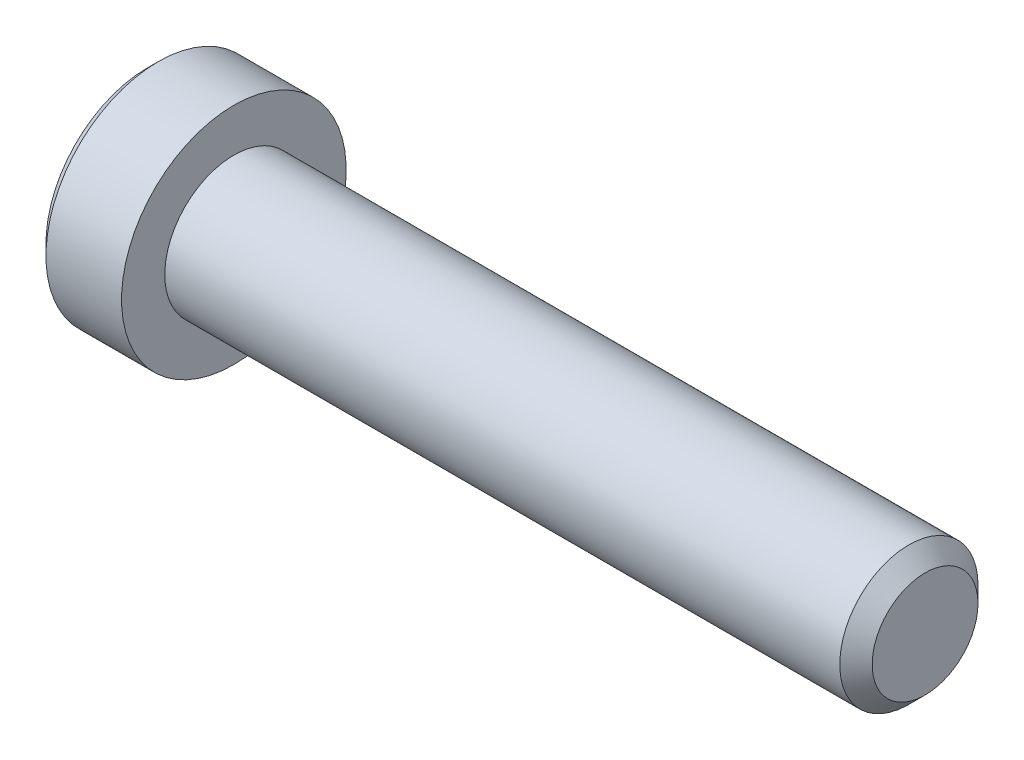
ISO-10303-21;
HEADER;
FILE_DESCRIPTION(('STEP AP214'),'2;1');
FILE_NAME('part.step','',(''),(''),'','','');
FILE_SCHEMA(('AUTOMOTIVE_DESIGN { 1 0 10303 214 1 1 1 1 }'));
ENDSEC;
DATA;
#1=APPLICATION_CONTEXT('core data for automotive mechanical design processes');
#2=APPLICATION_PROTOCOL_DEFINITION('international standard','automotive_design',2000,#1);
#3=PRODUCT_CONTEXT('',#1,'mechanical');
#4=PRODUCT('Part','Part','',(#3));
#5=PRODUCT_RELATED_PRODUCT_CATEGORY('part','',(#4));
#6=PRODUCT_DEFINITION_FORMATION('','',#4);
#7=PRODUCT_DEFINITION_CONTEXT('part definition',#1,'design');
#8=PRODUCT_DEFINITION('design','',#6,#7);
#9=PRODUCT_DEFINITION_SHAPE('','',#8);
#10=(LENGTH_UNIT() NAMED_UNIT(*) SI_UNIT(.MILLI.,.METRE.));
#11=(NAMED_UNIT(*) PLANE_ANGLE_UNIT() SI_UNIT($,.RADIAN.));
#12=(NAMED_UNIT(*) SI_UNIT($,.STERADIAN.) SOLID_ANGLE_UNIT());
#13=UNCERTAINTY_MEASURE_WITH_UNIT(LENGTH_MEASURE(1.E-05),#10,'distance_accuracy_value','');
#14=(GEOMETRIC_REPRESENTATION_CONTEXT(3) GLOBAL_UNCERTAINTY_ASSIGNED_CONTEXT((#13)) GLOBAL_UNIT_ASSIGNED_CONTEXT((#10,
#11,#12)) REPRESENTATION_CONTEXT('',''));
#15=CARTESIAN_POINT('',(0.,0.,0.));
#16=DIRECTION('',(0.,0.,1.));
#17=DIRECTION('',(1.,0.,0.));
#18=AXIS2_PLACEMENT_3D('',#15,#16,#17);
#19=CARTESIAN_POINT('',(-25.,5.87499999999999,0.));
#20=DIRECTION('',(-1.,0.,0.));
#21=DIRECTION('',(0.,-1.,0.));
#22=AXIS2_PLACEMENT_3D('',#19,#20,#21);
#23=PLANE('',#22);
#24=CARTESIAN_POINT('',(-25.,0.,0.));
#25=DIRECTION('',(-1.,0.,0.));
#26=DIRECTION('',(0.,-1.,0.));
#27=AXIS2_PLACEMENT_3D('',#24,#25,#26);
#28=CIRCLE('',#27,2.88675134594805);
#29=CARTESIAN_POINT('',(-25.,-2.886751345948,-2.21827764490534E-13));
#30=VERTEX_POINT('',#29);
#31=CARTESIAN_POINT('',(-25.,-1.44337567297417,2.49999999999982));
#32=VERTEX_POINT('',#31);
#33=EDGE_CURVE('E132',#30,#32,#28,.T.);
#34=ORIENTED_EDGE('',*,*,#33,.F.);
#35=CARTESIAN_POINT('',(-25.,-1.44337567297406,-2.5));
#36=VERTEX_POINT('',#35);
#37=EDGE_CURVE('E131',#36,#30,#28,.T.);
#38=ORIENTED_EDGE('',*,*,#37,.F.);
#39=CARTESIAN_POINT('',(-25.,1.44337567297395,-2.5));
#40=VERTEX_POINT('',#39);
#41=EDGE_CURVE('E101',#40,#36,#28,.T.);
#42=ORIENTED_EDGE('',*,*,#41,.F.);
#43=CARTESIAN_POINT('',(-25.,2.88675134594809,0.));
#44=VERTEX_POINT('',#43);
#45=EDGE_CURVE('E94',#44,#40,#28,.T.);
#46=ORIENTED_EDGE('',*,*,#45,.F.);
#47=CARTESIAN_POINT('',(-25.,1.44337567297395,2.5));
#48=VERTEX_POINT('',#47);
#49=EDGE_CURVE('E55',#48,#44,#28,.T.);
#50=ORIENTED_EDGE('',*,*,#49,.F.);
#51=EDGE_CURVE('E62',#32,#48,#28,.T.);
#52=ORIENTED_EDGE('',*,*,#51,.F.);
#53=EDGE_LOOP('',(#34,#38,#42,#46,#50,#52));
#54=FACE_BOUND('',#53,.T.);
#55=CARTESIAN_POINT('',(-25.,0.,0.));
#56=DIRECTION('',(1.,0.,0.));
#57=DIRECTION('',(0.,1.,0.));
#58=AXIS2_PLACEMENT_3D('',#55,#56,#57);
#59=CIRCLE('',#58,5.87499999999999);
#60=CARTESIAN_POINT('',(-25.,5.87499999999999,0.));
#61=VERTEX_POINT('',#60);
#62=EDGE_CURVE('E221',#61,#61,#59,.T.);
#63=ORIENTED_EDGE('',*,*,#62,.F.);
#64=EDGE_LOOP('',(#63));
#65=FACE_BOUND('',#64,.T.);
#66=ADVANCED_FACE('F35',(#54,#65),#23,.T.);
#67=CARTESIAN_POINT('',(-2.,0.,0.));
#68=DIRECTION('',(1.,0.,0.));
#69=DIRECTION('',(0.,0.,-1.));
#70=AXIS2_PLACEMENT_3D('',#67,#68,#69);
#71=CYLINDRICAL_SURFACE('',#70,4.);
#72=CARTESIAN_POINT('',(19.0625,0.,0.));
#73=DIRECTION('',(1.,0.,0.));
#74=DIRECTION('',(0.,0.,-1.));
#75=AXIS2_PLACEMENT_3D('',#72,#73,#74);
#76=CIRCLE('',#75,4.);
#77=CARTESIAN_POINT('',(19.0625,0.,-4.));
#78=VERTEX_POINT('',#77);
#79=EDGE_CURVE('E49',#78,#78,#76,.F.);
#80=ORIENTED_EDGE('',*,*,#79,.T.);
#81=EDGE_LOOP('',(#80));
#82=FACE_BOUND('',#81,.T.);
#83=CARTESIAN_POINT('',(-20.,0.,0.));
#84=DIRECTION('',(-1.,0.,0.));
#85=DIRECTION('',(0.,-1.,0.));
#86=AXIS2_PLACEMENT_3D('',#83,#84,#85);
#87=CIRCLE('',#86,4.);
#88=CARTESIAN_POINT('',(-20.,-4.00000000000001,0.));
#89=VERTEX_POINT('',#88);
#90=EDGE_CURVE('E214',#89,#89,#87,.T.);
#91=ORIENTED_EDGE('',*,*,#90,.F.);
#92=EDGE_LOOP('',(#91));
#93=FACE_BOUND('',#92,.T.);
#94=ADVANCED_FACE('F194',(#82,#93),#71,.T.);
#95=CARTESIAN_POINT('',(20.,0.,0.));
#96=DIRECTION('',(1.,0.,0.));
#97=DIRECTION('',(0.,0.,-1.));
#98=AXIS2_PLACEMENT_3D('',#95,#96,#97);
#99=PLANE('',#98);
#100=CARTESIAN_POINT('',(20.,0.,0.));
#101=DIRECTION('',(1.,0.,0.));
#102=DIRECTION('',(0.,0.,-1.));
#103=AXIS2_PLACEMENT_3D('',#100,#101,#102);
#104=CIRCLE('',#103,3.0625);
#105=CARTESIAN_POINT('',(20.,0.,-3.0625));
#106=VERTEX_POINT('',#105);
#107=EDGE_CURVE('E215',#106,#106,#104,.T.);
#108=ORIENTED_EDGE('',*,*,#107,.T.);
#109=EDGE_LOOP('',(#108));
#110=FACE_BOUND('',#109,.T.);
#111=ADVANCED_FACE('F202',(#110),#99,.T.);
#112=CARTESIAN_POINT('',(20.,0.,0.));
#113=DIRECTION('',(-1.,0.,0.));
#114=DIRECTION('',(0.,0.,1.));
#115=AXIS2_PLACEMENT_3D('',#112,#113,#114);
#116=CONICAL_SURFACE('',#115,3.0625,0.785398163397447);
#117=ORIENTED_EDGE('',*,*,#79,.F.);
#118=EDGE_LOOP('',(#117));
#119=FACE_BOUND('',#118,.T.);
#120=ORIENTED_EDGE('',*,*,#107,.F.);
#121=EDGE_LOOP('',(#120));
#122=FACE_BOUND('',#121,.T.);
#123=ADVANCED_FACE('F37',(#119,#122),#116,.T.);
#124=CARTESIAN_POINT('',(-20.,0.,0.));
#125=DIRECTION('',(1.,0.,0.));
#126=DIRECTION('',(0.,1.,0.));
#127=AXIS2_PLACEMENT_3D('',#124,#125,#126);
#128=CYLINDRICAL_SURFACE('',#127,6.5);
#129=CARTESIAN_POINT('',(-24.375,0.,0.));
#130=DIRECTION('',(1.,0.,0.));
#131=DIRECTION('',(0.,1.,0.));
#132=AXIS2_PLACEMENT_3D('',#129,#130,#131);
#133=CIRCLE('',#132,6.49999999999999);
#134=CARTESIAN_POINT('',(-24.375,6.49999999999999,0.));
#135=VERTEX_POINT('',#134);
#136=EDGE_CURVE('E216',#135,#135,#133,.T.);
#137=ORIENTED_EDGE('',*,*,#136,.T.);
#138=EDGE_LOOP('',(#137));
#139=FACE_BOUND('',#138,.T.);
#140=CARTESIAN_POINT('',(-20.,0.,0.));
#141=DIRECTION('',(1.,0.,0.));
#142=DIRECTION('',(0.,1.,0.));
#143=AXIS2_PLACEMENT_3D('',#140,#141,#142);
#144=CIRCLE('',#143,6.5);
#145=CARTESIAN_POINT('',(-20.,6.49999999999999,0.));
#146=VERTEX_POINT('',#145);
#147=EDGE_CURVE('E226',#146,#146,#144,.T.);
#148=ORIENTED_EDGE('',*,*,#147,.F.);
#149=EDGE_LOOP('',(#148));
#150=FACE_BOUND('',#149,.T.);
#151=ADVANCED_FACE('F197',(#139,#150),#128,.T.);
#152=CARTESIAN_POINT('',(-24.375,0.,0.));
#153=DIRECTION('',(1.,0.,0.));
#154=DIRECTION('',(0.,1.,0.));
#155=AXIS2_PLACEMENT_3D('',#152,#153,#154);
#156=CONICAL_SURFACE('',#155,6.49999999999999,0.785398163397448);
#157=ORIENTED_EDGE('',*,*,#62,.T.);
#158=EDGE_LOOP('',(#157));
#159=FACE_BOUND('',#158,.T.);
#160=ORIENTED_EDGE('',*,*,#136,.F.);
#161=EDGE_LOOP('',(#160));
#162=FACE_BOUND('',#161,.T.);
#163=ADVANCED_FACE('F190',(#159,#162),#156,.T.);
#164=CARTESIAN_POINT('',(-20.,6.49999999999999,0.));
#165=DIRECTION('',(1.,0.,0.));
#166=DIRECTION('',(0.,1.,0.));
#167=AXIS2_PLACEMENT_3D('',#164,#165,#166);
#168=PLANE('',#167);
#169=ORIENTED_EDGE('',*,*,#90,.T.);
#170=EDGE_LOOP('',(#169));
#171=FACE_BOUND('',#170,.T.);
#172=ORIENTED_EDGE('',*,*,#147,.T.);
#173=EDGE_LOOP('',(#172));
#174=FACE_BOUND('',#173,.T.);
#175=ADVANCED_FACE('F154',(#171,#174),#168,.T.);
#176=CARTESIAN_POINT('',(-25.,0.,0.));
#177=DIRECTION('',(-1.,0.,0.));
#178=DIRECTION('',(0.,-1.,0.));
#179=AXIS2_PLACEMENT_3D('',#176,#177,#178);
#180=CONICAL_SURFACE('',#179,2.88675134594805,0.78539816339745);
#181=CARTESIAN_POINT('',(-25.9259641937848,-2.87868021616152,-2.5));
#182=CARTESIAN_POINT('',(-25.8730547693996,-2.80858751756352,-2.5));
#183=CARTESIAN_POINT('',(-25.8206567848066,-2.73810237384455,-2.5));
#184=CARTESIAN_POINT('',(-25.7171126835153,-2.59619238907467,-2.5));
#185=CARTESIAN_POINT('',(-25.665966884378,-2.5247673165714,-2.5));
#186=CARTESIAN_POINT('',(-25.5647924979815,-2.38030019419695,-2.5));
#187=CARTESIAN_POINT('',(-25.5147756377846,-2.30724990359397,-2.5));
#188=CARTESIAN_POINT('',(-25.4166088439156,-2.15990937397291,-2.5));
#189=CARTESIAN_POINT('',(-25.3684587783456,-2.0856192230894,-2.5));
#190=CARTESIAN_POINT('',(-25.2717465594521,-1.93130274871405,-2.5));
#191=CARTESIAN_POINT('',(-25.2233189325374,-1.85119168497847,-2.5));
#192=CARTESIAN_POINT('',(-25.1296640597042,-1.68912282627165,-2.5));
#193=CARTESIAN_POINT('',(-25.0844363916949,-1.60716527674861,-2.5));
#194=CARTESIAN_POINT('',(-24.9981353746694,-1.44137668632316,-2.5));
#195=CARTESIAN_POINT('',(-24.9570503726637,-1.35755175925793,-2.5));
#196=CARTESIAN_POINT('',(-24.8799618661067,-1.18761577759417,-2.5));
#197=CARTESIAN_POINT('',(-24.8439560607347,-1.10150577924726,-2.5));
#198=CARTESIAN_POINT('',(-24.7809497442852,-0.933895283730339,-2.5));
#199=CARTESIAN_POINT('',(-24.7534577201432,-0.852581486652376,-2.5));
#200=CARTESIAN_POINT('',(-24.7049971144175,-0.687996185051388,-2.5));
#201=CARTESIAN_POINT('',(-24.6840289822391,-0.604724546085125,-2.5));
#202=CARTESIAN_POINT('',(-24.6500599950131,-0.438105786501611,-2.5));
#203=CARTESIAN_POINT('',(-24.6369226334437,-0.354786957377843,-2.5));
#204=CARTESIAN_POINT('',(-24.6188701943997,-0.187258638268732,-2.5));
#205=CARTESIAN_POINT('',(-24.6139537035303,-0.103049303891692,-2.5));
#206=CARTESIAN_POINT('',(-24.612708074372,0.0623819458555907,-2.5));
#207=CARTESIAN_POINT('',(-24.616074551711,0.143601667742536,-2.5));
#208=CARTESIAN_POINT('',(-24.630537592381,0.305344840534007,-2.5));
#209=CARTESIAN_POINT('',(-24.6416349066532,0.3858682230297,-2.5));
#210=CARTESIAN_POINT('',(-24.6711420785854,0.546999992477774,-2.5));
#211=CARTESIAN_POINT('',(-24.689676376831,0.627585258156424,-2.5));
#212=CARTESIAN_POINT('',(-24.7330723320141,0.786991930978632,-2.5));
#213=CARTESIAN_POINT('',(-24.7579334595175,0.865813485110869,-2.5));
#214=CARTESIAN_POINT('',(-24.8455589112399,1.11399280220495,-2.5));
#215=CARTESIAN_POINT('',(-24.9183033354747,1.27984027529461,-2.5));
#216=CARTESIAN_POINT('',(-25.0395423452679,1.52253018655043,-2.5));
#217=CARTESIAN_POINT('',(-25.0820714512073,1.60256472908883,-2.5));
#218=CARTESIAN_POINT('',(-25.1703965241523,1.76081489282129,-2.5));
#219=CARTESIAN_POINT('',(-25.2161919024768,1.83903083842891,-2.5));
#220=CARTESIAN_POINT('',(-25.3080446787287,1.99000684607172,-2.5));
#221=CARTESIAN_POINT('',(-25.3539756354245,2.06284472030449,-2.5));
#222=CARTESIAN_POINT('',(-25.4477702453866,2.20727164736139,-2.5));
#223=CARTESIAN_POINT('',(-25.4956340450437,2.27886060500406,-2.5));
#224=CARTESIAN_POINT('',(-25.5925522363184,2.42037078548407,-2.5));
#225=CARTESIAN_POINT('',(-25.6415937983163,2.49030083172882,-2.5));
#226=CARTESIAN_POINT('',(-25.7409738351899,2.62920524991562,-2.5));
#227=CARTESIAN_POINT('',(-25.7913119497075,2.69817987937844,-2.5));
#228=CARTESIAN_POINT('',(-25.8421802976825,2.76675463365827,-2.5));
#229=B_SPLINE_CURVE_WITH_KNOTS('',3,(#181,#182,#183,#184,#185,#186,#187,#188,#189,#190,#191,
#192,#193,#194,#195,#196,#197,#198,#199,#200,#201,#202,#203,#204,#205,#206,#207,#208,#209,#210,
#211,#212,#213,#214,#215,#216,#217,#218,#219,#220,#221,#222,#223,#224,#225,#226,#227,#228),
.UNSPECIFIED.,.F.,.F.,(4,2,2,2,2,2,2,2,2,2,2,2,2,2,2,2,2,2,2,2,2,2,2,4),(0.,0.263465914971117,
0.526997968323239,0.792571943279365,1.05812711983772,1.33890112548019,1.6196380262908,
1.89956181222217,2.17935838571899,2.43663887682602,2.69393708705249,2.94660788173137,
3.19923523085018,3.44271854486788,3.68622551313362,3.93398926860575,4.18173229781971,
4.7233400484191,4.99521600382016,5.26704308216968,5.52534341671995,5.78366335141088,
6.03988492204048,6.29603603207543),.UNSPECIFIED.);
#230=EDGE_CURVE('E11',#36,#40,#229,.T.);
#231=ORIENTED_EDGE('',*,*,#230,.T.);
#232=ORIENTED_EDGE('',*,*,#41,.T.);
#233=EDGE_LOOP('',(#231,#232));
#234=FACE_BOUND('',#233,.T.);
#235=ADVANCED_FACE('F106',(#234),#180,.F.);
#236=CARTESIAN_POINT('',(-25.0001154769819,-2.88686681600197,0.000200000000000427));
#237=CARTESIAN_POINT('',(-24.9505407053549,-2.83725032818751,-0.0857382777877657));
#238=CARTESIAN_POINT('',(-24.9038774813626,-2.78680418128109,-0.173113567275755));
#239=CARTESIAN_POINT('',(-24.8184381400384,-2.6839389026696,-0.351281456165593));
#240=CARTESIAN_POINT('',(-24.7797095624061,-2.6315099876986,-0.442091000681081));
#241=CARTESIAN_POINT('',(-24.7133667038979,-2.52578957716233,-0.62520412312693));
#242=CARTESIAN_POINT('',(-24.685585668531,-2.47252500720903,-0.717461064529351));
#243=CARTESIAN_POINT('',(-24.6427831759108,-2.36482323343209,-0.904006008776299));
#244=CARTESIAN_POINT('',(-24.6277297666715,-2.31038931995912,-0.998288312566298));
#245=CARTESIAN_POINT('',(-24.6141477222096,-2.21657570605386,-1.16077825829186));
#246=CARTESIAN_POINT('',(-24.6121370992409,-2.17731721011877,-1.22877596788017));
#247=CARTESIAN_POINT('',(-24.6155241171876,-2.09886438835669,-1.36466024116924));
#248=CARTESIAN_POINT('',(-24.6209243553,-2.05967008984861,-1.43254675755226));
#249=CARTESIAN_POINT('',(-24.6388257884026,-1.98165157555713,-1.56767878823613));
#250=CARTESIAN_POINT('',(-24.6513349270466,-1.94282782326095,-1.63492349975358));
#251=CARTESIAN_POINT('',(-24.6827675019558,-1.86585167424614,-1.76825010081822));
#252=CARTESIAN_POINT('',(-24.7016904464969,-1.82769922629676,-1.83433207909968));
#253=CARTESIAN_POINT('',(-24.7578673614084,-1.72997445583856,-2.00359634669129));
#254=CARTESIAN_POINT('',(-24.7993558315963,-1.6710080703923,-2.10572912222291));
#255=CARTESIAN_POINT('',(-24.8693940467232,-1.58430317001562,-2.25590641494052));
#256=CARTESIAN_POINT('',(-24.8940022521162,-1.55573003305807,-2.30539653988262));
#257=CARTESIAN_POINT('',(-24.9454618867154,-1.49911303110425,-2.40346006383885));
#258=CARTESIAN_POINT('',(-24.9723119387795,-1.47106885396706,-2.45203400349693));
#259=CARTESIAN_POINT('',(-25.0001154769819,-1.44326020292023,-2.5002));
#260=B_SPLINE_CURVE_WITH_KNOTS('',3,(#236,#237,#238,#239,#240,#241,#242,#243,#244,#245,#246,
#247,#248,#249,#250,#251,#252,#253,#254,#255,#256,#257,#258,#259),.UNSPECIFIED.,.F.,.F.,(4,2,2,
2,2,2,2,2,2,2,2,4),(0.,0.333012085133929,0.667964518301407,0.997597032043316,1.32639954393846,
1.56169424147171,1.79707142102086,2.03271213522174,2.26833478775654,2.64260240809535,
2.82922877818864,3.01574133749024),.UNSPECIFIED.);
#261=EDGE_CURVE('E134',#30,#36,#260,.T.);
#262=ORIENTED_EDGE('',*,*,#261,.T.);
#263=ORIENTED_EDGE('',*,*,#37,.T.);
#264=EDGE_LOOP('',(#262,#263));
#265=FACE_BOUND('',#264,.T.);
#266=ADVANCED_FACE('F153',(#265),#180,.F.);
#267=CARTESIAN_POINT('',(-25.0001154769819,-1.44326020292023,2.5002));
#268=CARTESIAN_POINT('',(-24.9505407053548,-1.49287669073468,2.41426172221224));
#269=CARTESIAN_POINT('',(-24.9038774813626,-1.5433228376411,2.32688643272425));
#270=CARTESIAN_POINT('',(-24.8184381400384,-1.64618811625259,2.14871854383442));
#271=CARTESIAN_POINT('',(-24.7797095624061,-1.69861703122359,2.05790899931893));
#272=CARTESIAN_POINT('',(-24.7133667038979,-1.80433744175985,1.87479587687309));
#273=CARTESIAN_POINT('',(-24.685585668531,-1.85760201171315,1.78253893547067));
#274=CARTESIAN_POINT('',(-24.6427831759108,-1.96530378549008,1.59599399122373));
#275=CARTESIAN_POINT('',(-24.6277297666715,-2.01973769896306,1.50171168743373));
#276=CARTESIAN_POINT('',(-24.6141477222096,-2.11355131286832,1.33922174170817));
#277=CARTESIAN_POINT('',(-24.6121370992409,-2.1528098088034,1.27122403211987));
#278=CARTESIAN_POINT('',(-24.6155241171876,-2.23126263056548,1.1353397588308));
#279=CARTESIAN_POINT('',(-24.6209243553,-2.27045692907357,1.06745324244778));
#280=CARTESIAN_POINT('',(-24.6388257884026,-2.34847544336504,0.932321211763908));
#281=CARTESIAN_POINT('',(-24.6513349270466,-2.38729919566122,0.865076500246452));
#282=CARTESIAN_POINT('',(-24.6827675019558,-2.46427534467603,0.731749899181812));
#283=CARTESIAN_POINT('',(-24.701690446497,-2.50242779262541,0.665667920900354));
#284=CARTESIAN_POINT('',(-24.7578673614084,-2.60015256308361,0.496403653308744));
#285=CARTESIAN_POINT('',(-24.7993558315963,-2.65911894852988,0.394270877777114));
#286=CARTESIAN_POINT('',(-24.8693940467232,-2.74582384890657,0.244093585059496));
#287=CARTESIAN_POINT('',(-24.8940022521162,-2.77439698586412,0.194603460117394));
#288=CARTESIAN_POINT('',(-24.9454618867154,-2.83101398781794,0.096539936161155));
#289=CARTESIAN_POINT('',(-24.9723119387795,-2.85905816495513,0.0479659965030732));
#290=CARTESIAN_POINT('',(-25.0001154769819,-2.88686681600197,-0.000199999999999504));
#291=B_SPLINE_CURVE_WITH_KNOTS('',3,(#267,#268,#269,#270,#271,#272,#273,#274,#275,#276,#277,
#278,#279,#280,#281,#282,#283,#284,#285,#286,#287,#288,#289,#290),.UNSPECIFIED.,.F.,.F.,(4,2,2,
2,2,2,2,2,2,2,2,4),(0.,0.333012085133919,0.667964518301383,0.997597032043278,1.32639954393842,
1.56169424147166,1.79707142102081,2.03271213522169,2.26833478775649,2.64260240809532,
2.82922877818863,3.01574133749024),.UNSPECIFIED.);
#292=EDGE_CURVE('E141',#32,#30,#291,.T.);
#293=ORIENTED_EDGE('',*,*,#292,.T.);
#294=ORIENTED_EDGE('',*,*,#33,.T.);
#295=EDGE_LOOP('',(#293,#294));
#296=FACE_BOUND('',#295,.T.);
#297=ADVANCED_FACE('F259',(#296),#180,.F.);
#298=CARTESIAN_POINT('',(-25.9259641937848,-2.87868021616152,2.5));
#299=CARTESIAN_POINT('',(-25.8730547693996,-2.80858751756352,2.5));
#300=CARTESIAN_POINT('',(-25.8206567848066,-2.73810237384455,2.5));
#301=CARTESIAN_POINT('',(-25.7171126835153,-2.59619238907467,2.5));
#302=CARTESIAN_POINT('',(-25.665966884378,-2.5247673165714,2.5));
#303=CARTESIAN_POINT('',(-25.5647924979815,-2.38030019419695,2.5));
#304=CARTESIAN_POINT('',(-25.5147756377846,-2.30724990359396,2.5));
#305=CARTESIAN_POINT('',(-25.4166088439156,-2.15990937397291,2.5));
#306=CARTESIAN_POINT('',(-25.3684587783456,-2.0856192230894,2.5));
#307=CARTESIAN_POINT('',(-25.2717465594521,-1.93130274871405,2.5));
#308=CARTESIAN_POINT('',(-25.2233189325374,-1.85119168497847,2.5));
#309=CARTESIAN_POINT('',(-25.1296640597042,-1.68912282627164,2.5));
#310=CARTESIAN_POINT('',(-25.0844363916949,-1.60716527674861,2.5));
#311=CARTESIAN_POINT('',(-24.9981353746694,-1.44137668632315,2.5));
#312=CARTESIAN_POINT('',(-24.9570503726637,-1.35755175925792,2.5));
#313=CARTESIAN_POINT('',(-24.8799618661067,-1.18761577759417,2.5));
#314=CARTESIAN_POINT('',(-24.8439560607347,-1.10150577924726,2.5));
#315=CARTESIAN_POINT('',(-24.7809497442852,-0.933895283730338,2.5));
#316=CARTESIAN_POINT('',(-24.7534577201432,-0.852581486652376,2.5));
#317=CARTESIAN_POINT('',(-24.7049971144175,-0.687996185051388,2.5));
#318=CARTESIAN_POINT('',(-24.6840289822391,-0.604724546085125,2.5));
#319=CARTESIAN_POINT('',(-24.6500599950131,-0.438105786501611,2.5));
#320=CARTESIAN_POINT('',(-24.6369226334437,-0.354786957377842,2.5));
#321=CARTESIAN_POINT('',(-24.6188701943997,-0.187258638268732,2.5));
#322=CARTESIAN_POINT('',(-24.6139537035303,-0.103049303891693,2.5));
#323=CARTESIAN_POINT('',(-24.612708074372,0.0623819458555903,2.5));
#324=CARTESIAN_POINT('',(-24.616074551711,0.143601667742536,2.5));
#325=CARTESIAN_POINT('',(-24.630537592381,0.305344840534006,2.5));
#326=CARTESIAN_POINT('',(-24.6416349066532,0.3858682230297,2.5));
#327=CARTESIAN_POINT('',(-24.6711420785854,0.546999992477773,2.5));
#328=CARTESIAN_POINT('',(-24.689676376831,0.627585258156423,2.5));
#329=CARTESIAN_POINT('',(-24.7330723320141,0.786991930978631,2.5));
#330=CARTESIAN_POINT('',(-24.7579334595175,0.865813485110868,2.5));
#331=CARTESIAN_POINT('',(-24.8455589112399,1.11399280220495,2.5));
#332=CARTESIAN_POINT('',(-24.9183033354747,1.2798402752946,2.5));
#333=CARTESIAN_POINT('',(-25.0395423452679,1.52253018655042,2.5));
#334=CARTESIAN_POINT('',(-25.0820714512073,1.60256472908883,2.5));
#335=CARTESIAN_POINT('',(-25.1703965241523,1.76081489282128,2.5));
#336=CARTESIAN_POINT('',(-25.2161919024768,1.83903083842891,2.5));
#337=CARTESIAN_POINT('',(-25.3080446787287,1.99000684607172,2.5));
#338=CARTESIAN_POINT('',(-25.3539756354245,2.06284472030448,2.5));
#339=CARTESIAN_POINT('',(-25.4477702453866,2.20727164736139,2.5));
#340=CARTESIAN_POINT('',(-25.4956340450437,2.27886060500406,2.5));
#341=CARTESIAN_POINT('',(-25.5925522363184,2.42037078548407,2.5));
#342=CARTESIAN_POINT('',(-25.6415937983163,2.49030083172882,2.5));
#343=CARTESIAN_POINT('',(-25.7409738351899,2.62920524991562,2.5));
#344=CARTESIAN_POINT('',(-25.7913119497075,2.69817987937844,2.5));
#345=CARTESIAN_POINT('',(-25.8421802976825,2.76675463365827,2.5));
#346=B_SPLINE_CURVE_WITH_KNOTS('',3,(#298,#299,#300,#301,#302,#303,#304,#305,#306,#307,#308,
#309,#310,#311,#312,#313,#314,#315,#316,#317,#318,#319,#320,#321,#322,#323,#324,#325,#326,#327,
#328,#329,#330,#331,#332,#333,#334,#335,#336,#337,#338,#339,#340,#341,#342,#343,#344,#345),
.UNSPECIFIED.,.F.,.F.,(4,2,2,2,2,2,2,2,2,2,2,2,2,2,2,2,2,2,2,2,2,2,2,4),(0.,0.263465914971117,
0.526997968323239,0.792571943279366,1.05812711983772,1.33890112548019,1.6196380262908,
1.89956181222217,2.17935838571899,2.43663887682602,2.69393708705249,2.94660788173137,
3.19923523085018,3.44271854486788,3.68622551313361,3.93398926860575,4.1817322978197,
4.7233400484191,4.99521600382016,5.26704308216968,5.52534341671995,5.78366335141088,
6.03988492204048,6.29603603207542),.UNSPECIFIED.);
#347=EDGE_CURVE('E161',#48,#32,#346,.F.);
#348=ORIENTED_EDGE('',*,*,#347,.T.);
#349=ORIENTED_EDGE('',*,*,#51,.T.);
#350=EDGE_LOOP('',(#348,#349));
#351=FACE_BOUND('',#350,.T.);
#352=ADVANCED_FACE('F275',(#351),#180,.F.);
#353=CARTESIAN_POINT('',(-25.0001154769818,2.88686681600197,-0.000199999999999577));
#354=CARTESIAN_POINT('',(-24.9505407053548,2.83725032818751,0.0857382777877633));
#355=CARTESIAN_POINT('',(-24.9038774813625,2.7868041812811,0.17311356727575));
#356=CARTESIAN_POINT('',(-24.8184381400383,2.68393890266961,0.351281456165583));
#357=CARTESIAN_POINT('',(-24.779709562406,2.6315099876986,0.442091000681068));
#358=CARTESIAN_POINT('',(-24.7133667038978,2.52578957716234,0.625204123126912));
#359=CARTESIAN_POINT('',(-24.6855856685309,2.47252500720904,0.71746106452933));
#360=CARTESIAN_POINT('',(-24.6427831759107,2.36482323343211,0.904006008776273));
#361=CARTESIAN_POINT('',(-24.6277297666714,2.31038931995914,0.998288312566269));
#362=CARTESIAN_POINT('',(-24.6141477222095,2.21657570605388,1.16077825829183));
#363=CARTESIAN_POINT('',(-24.6121370992408,2.17731721011879,1.22877596788013));
#364=CARTESIAN_POINT('',(-24.6155241171875,2.09886438835671,1.3646602411692));
#365=CARTESIAN_POINT('',(-24.6209243552999,2.05967008984863,1.43254675755222));
#366=CARTESIAN_POINT('',(-24.6388257884025,1.98165157555716,1.56767878823608));
#367=CARTESIAN_POINT('',(-24.6513349270465,1.94282782326098,1.63492349975354));
#368=CARTESIAN_POINT('',(-24.6827675019557,1.86585167424617,1.76825010081817));
#369=CARTESIAN_POINT('',(-24.7016904464969,1.82769922629679,1.83433207909963));
#370=CARTESIAN_POINT('',(-24.7578673614083,1.72997445583859,2.00359634669124));
#371=CARTESIAN_POINT('',(-24.7993558315962,1.67100807039232,2.10572912222288));
#372=CARTESIAN_POINT('',(-24.8693940467231,1.58430317001563,2.2559064149405));
#373=CARTESIAN_POINT('',(-24.8940022521161,1.55573003305808,2.3053965398826));
#374=CARTESIAN_POINT('',(-24.9454618867153,1.49911303110426,2.40346006383884));
#375=CARTESIAN_POINT('',(-24.9723119387794,1.47106885396706,2.45203400349693));
#376=CARTESIAN_POINT('',(-25.0001154769818,1.44326020292023,2.5002));
#377=B_SPLINE_CURVE_WITH_KNOTS('',3,(#353,#354,#355,#356,#357,#358,#359,#360,#361,#362,#363,
#364,#365,#366,#367,#368,#369,#370,#371,#372,#373,#374,#375,#376),.UNSPECIFIED.,.F.,.F.,(4,2,2,
2,2,2,2,2,2,2,2,4),(0.,0.333012085133919,0.667964518301387,0.997597032043284,1.32639954393842,
1.56169424147166,1.7970714210208,2.03271213522168,2.26833478775647,2.64260240809532,
2.82922877818863,3.01574133749025),.UNSPECIFIED.);
#378=EDGE_CURVE('E121',#44,#48,#377,.T.);
#379=ORIENTED_EDGE('',*,*,#378,.T.);
#380=ORIENTED_EDGE('',*,*,#49,.T.);
#381=EDGE_LOOP('',(#379,#380));
#382=FACE_BOUND('',#381,.T.);
#383=ADVANCED_FACE('F251',(#382),#180,.F.);
#384=CARTESIAN_POINT('',(-25.0001154769818,1.44326020292023,-2.5002));
#385=CARTESIAN_POINT('',(-24.9505407053548,1.49287669073469,-2.41426172221223));
#386=CARTESIAN_POINT('',(-24.9038774813626,1.5433228376411,-2.32688643272424));
#387=CARTESIAN_POINT('',(-24.8184381400384,1.64618811625259,-2.14871854383441));
#388=CARTESIAN_POINT('',(-24.7797095624061,1.6986170312236,-2.05790899931892));
#389=CARTESIAN_POINT('',(-24.7133667038978,1.80433744175986,-1.87479587687307));
#390=CARTESIAN_POINT('',(-24.6855856685309,1.85760201171316,-1.78253893547065));
#391=CARTESIAN_POINT('',(-24.6427831759107,1.9653037854901,-1.5959939912237));
#392=CARTESIAN_POINT('',(-24.6277297666714,2.01973769896307,-1.5017116874337));
#393=CARTESIAN_POINT('',(-24.6141477222095,2.11355131286834,-1.33922174170814));
#394=CARTESIAN_POINT('',(-24.6121370992408,2.15280980880342,-1.27122403211983));
#395=CARTESIAN_POINT('',(-24.6155241171875,2.2312626305655,-1.13533975883077));
#396=CARTESIAN_POINT('',(-24.6209243552999,2.27045692907358,-1.06745324244775));
#397=CARTESIAN_POINT('',(-24.6388257884025,2.34847544336505,-0.932321211763882));
#398=CARTESIAN_POINT('',(-24.6513349270465,2.38729919566123,-0.865076500246428));
#399=CARTESIAN_POINT('',(-24.6827675019557,2.46427534467604,-0.731749899181791));
#400=CARTESIAN_POINT('',(-24.7016904464969,2.50242779262542,-0.665667920900333));
#401=CARTESIAN_POINT('',(-24.7578673614083,2.60015256308362,-0.496403653308728));
#402=CARTESIAN_POINT('',(-24.7993558315962,2.65911894852989,-0.394270877777101));
#403=CARTESIAN_POINT('',(-24.8693940467231,2.74582384890657,-0.244093585059487));
#404=CARTESIAN_POINT('',(-24.8940022521161,2.77439698586412,-0.194603460117387));
#405=CARTESIAN_POINT('',(-24.9454618867153,2.83101398781794,-0.096539936161151));
#406=CARTESIAN_POINT('',(-24.9723119387794,2.85905816495513,-0.0479659965030704));
#407=CARTESIAN_POINT('',(-25.0001154769818,2.88686681600197,0.000200000000001339));
#408=B_SPLINE_CURVE_WITH_KNOTS('',3,(#384,#385,#386,#387,#388,#389,#390,#391,#392,#393,#394,
#395,#396,#397,#398,#399,#400,#401,#402,#403,#404,#405,#406,#407),.UNSPECIFIED.,.F.,.F.,(4,2,2,
2,2,2,2,2,2,2,2,4),(0.,0.333012085133931,0.667964518301411,0.997597032043318,1.32639954393847,
1.56169424147171,1.79707142102085,2.03271213522172,2.26833478775652,2.64260240809534,
2.82922877818864,3.01574133749025),.UNSPECIFIED.);
#409=EDGE_CURVE('E97',#40,#44,#408,.T.);
#410=ORIENTED_EDGE('',*,*,#409,.T.);
#411=ORIENTED_EDGE('',*,*,#45,.T.);
#412=EDGE_LOOP('',(#410,#411));
#413=FACE_BOUND('',#412,.T.);
#414=ADVANCED_FACE('F95',(#413),#180,.F.);
#415=CARTESIAN_POINT('',(-21.05,2.88675134594813,0.));
#416=DIRECTION('',(1.,0.,0.));
#417=DIRECTION('',(0.,0.,-1.));
#418=AXIS2_PLACEMENT_3D('',#415,#416,#417);
#419=PLANE('',#418);
#420=DIRECTION('',(0.,0.5,0.866025403784439));
#421=VECTOR('',#420,1.);
#422=CARTESIAN_POINT('',(-21.05,1.44337567297406,-2.5));
#423=LINE('',#422,#421);
#424=CARTESIAN_POINT('',(-21.05,1.44337567297406,-2.5));
#425=VERTEX_POINT('',#424);
#426=CARTESIAN_POINT('',(-21.05,2.88675134594813,0.));
#427=VERTEX_POINT('',#426);
#428=EDGE_CURVE('E120',#425,#427,#423,.T.);
#429=ORIENTED_EDGE('',*,*,#428,.F.);
#430=DIRECTION('',(0.,1.,0.));
#431=VECTOR('',#430,1.);
#432=CARTESIAN_POINT('',(-21.05,-1.44337567297406,-2.5));
#433=LINE('',#432,#431);
#434=CARTESIAN_POINT('',(-21.05,-1.44337567297406,-2.5));
#435=VERTEX_POINT('',#434);
#436=EDGE_CURVE('E125',#435,#425,#433,.T.);
#437=ORIENTED_EDGE('',*,*,#436,.F.);
#438=DIRECTION('',(0.,0.5,-0.866025403784439));
#439=VECTOR('',#438,1.);
#440=CARTESIAN_POINT('',(-21.05,-2.88675134594813,0.));
#441=LINE('',#440,#439);
#442=CARTESIAN_POINT('',(-21.05,-2.88675134594813,0.));
#443=VERTEX_POINT('',#442);
#444=EDGE_CURVE('E241',#443,#435,#441,.T.);
#445=ORIENTED_EDGE('',*,*,#444,.F.);
#446=DIRECTION('',(0.,-0.5,-0.866025403784439));
#447=VECTOR('',#446,1.);
#448=CARTESIAN_POINT('',(-21.05,-1.44337567297406,2.5));
#449=LINE('',#448,#447);
#450=CARTESIAN_POINT('',(-21.05,-1.44337567297406,2.5));
#451=VERTEX_POINT('',#450);
#452=EDGE_CURVE('E243',#451,#443,#449,.T.);
#453=ORIENTED_EDGE('',*,*,#452,.F.);
#454=DIRECTION('',(0.,-1.,0.));
#455=VECTOR('',#454,1.);
#456=CARTESIAN_POINT('',(-21.05,1.44337567297406,2.5));
#457=LINE('',#456,#455);
#458=CARTESIAN_POINT('',(-21.05,1.44337567297406,2.5));
#459=VERTEX_POINT('',#458);
#460=EDGE_CURVE('E245',#459,#451,#457,.T.);
#461=ORIENTED_EDGE('',*,*,#460,.F.);
#462=DIRECTION('',(0.,-0.5,0.866025403784439));
#463=VECTOR('',#462,1.);
#464=CARTESIAN_POINT('',(-21.05,2.88675134594813,0.));
#465=LINE('',#464,#463);
#466=EDGE_CURVE('E247',#427,#459,#465,.T.);
#467=ORIENTED_EDGE('',*,*,#466,.F.);
#468=EDGE_LOOP('',(#429,#437,#445,#453,#461,#467));
#469=FACE_BOUND('',#468,.T.);
#470=ADVANCED_FACE('F155',(#469),#419,.F.);
#471=CARTESIAN_POINT('',(-21.05,-1.44337567297406,-2.5));
#472=DIRECTION('',(0.,0.,1.));
#473=DIRECTION('',(1.,0.,0.));
#474=AXIS2_PLACEMENT_3D('',#471,#472,#473);
#475=PLANE('',#474);
#476=ORIENTED_EDGE('',*,*,#230,.F.);
#477=DIRECTION('',(-1.,0.,0.));
#478=VECTOR('',#477,1.);
#479=CARTESIAN_POINT('',(-21.05,-1.44337567297406,-2.5));
#480=LINE('',#479,#478);
#481=EDGE_CURVE('E126',#435,#36,#480,.T.);
#482=ORIENTED_EDGE('',*,*,#481,.F.);
#483=ORIENTED_EDGE('',*,*,#436,.T.);
#484=DIRECTION('',(-1.,0.,0.));
#485=VECTOR('',#484,1.);
#486=CARTESIAN_POINT('',(-21.05,1.44337567297406,-2.5));
#487=LINE('',#486,#485);
#488=EDGE_CURVE('E116',#425,#40,#487,.T.);
#489=ORIENTED_EDGE('',*,*,#488,.T.);
#490=EDGE_LOOP('',(#476,#482,#483,#489));
#491=FACE_BOUND('',#490,.T.);
#492=ADVANCED_FACE('F123',(#491),#475,.T.);
#493=CARTESIAN_POINT('',(-21.05,-2.88675134594813,0.));
#494=DIRECTION('',(0.,0.866025403784439,0.5));
#495=DIRECTION('',(0.,-0.5,0.866025403784439));
#496=AXIS2_PLACEMENT_3D('',#493,#494,#495);
#497=PLANE('',#496);
#498=ORIENTED_EDGE('',*,*,#261,.F.);
#499=DIRECTION('',(-1.,0.,0.));
#500=VECTOR('',#499,1.);
#501=CARTESIAN_POINT('',(-21.05,-2.88675134594813,0.));
#502=LINE('',#501,#500);
#503=EDGE_CURVE('E236',#443,#30,#502,.T.);
#504=ORIENTED_EDGE('',*,*,#503,.F.);
#505=ORIENTED_EDGE('',*,*,#444,.T.);
#506=ORIENTED_EDGE('',*,*,#481,.T.);
#507=EDGE_LOOP('',(#498,#504,#505,#506));
#508=FACE_BOUND('',#507,.T.);
#509=ADVANCED_FACE('F148',(#508),#497,.T.);
#510=CARTESIAN_POINT('',(-21.05,-1.44337567297406,2.5));
#511=DIRECTION('',(0.,0.866025403784439,-0.5));
#512=DIRECTION('',(0.,0.5,0.866025403784439));
#513=AXIS2_PLACEMENT_3D('',#510,#511,#512);
#514=PLANE('',#513);
#515=ORIENTED_EDGE('',*,*,#292,.F.);
#516=DIRECTION('',(-1.,0.,0.));
#517=VECTOR('',#516,1.);
#518=CARTESIAN_POINT('',(-21.05,-1.44337567297406,2.5));
#519=LINE('',#518,#517);
#520=EDGE_CURVE('E233',#451,#32,#519,.T.);
#521=ORIENTED_EDGE('',*,*,#520,.F.);
#522=ORIENTED_EDGE('',*,*,#452,.T.);
#523=ORIENTED_EDGE('',*,*,#503,.T.);
#524=EDGE_LOOP('',(#515,#521,#522,#523));
#525=FACE_BOUND('',#524,.T.);
#526=ADVANCED_FACE('F265',(#525),#514,.T.);
#527=CARTESIAN_POINT('',(-21.05,1.44337567297406,2.5));
#528=DIRECTION('',(0.,0.,-1.));
#529=DIRECTION('',(-1.,0.,0.));
#530=AXIS2_PLACEMENT_3D('',#527,#528,#529);
#531=PLANE('',#530);
#532=ORIENTED_EDGE('',*,*,#347,.F.);
#533=DIRECTION('',(-1.,0.,0.));
#534=VECTOR('',#533,1.);
#535=CARTESIAN_POINT('',(-21.05,1.44337567297406,2.5));
#536=LINE('',#535,#534);
#537=EDGE_CURVE('E230',#459,#48,#536,.T.);
#538=ORIENTED_EDGE('',*,*,#537,.F.);
#539=ORIENTED_EDGE('',*,*,#460,.T.);
#540=ORIENTED_EDGE('',*,*,#520,.T.);
#541=EDGE_LOOP('',(#532,#538,#539,#540));
#542=FACE_BOUND('',#541,.T.);
#543=ADVANCED_FACE('F182',(#542),#531,.T.);
#544=CARTESIAN_POINT('',(-21.05,2.88675134594813,0.));
#545=DIRECTION('',(0.,-0.866025403784439,-0.5));
#546=DIRECTION('',(0.,0.5,-0.866025403784439));
#547=AXIS2_PLACEMENT_3D('',#544,#545,#546);
#548=PLANE('',#547);
#549=ORIENTED_EDGE('',*,*,#378,.F.);
#550=DIRECTION('',(-1.,0.,0.));
#551=VECTOR('',#550,1.);
#552=CARTESIAN_POINT('',(-21.05,2.88675134594813,0.));
#553=LINE('',#552,#551);
#554=EDGE_CURVE('E119',#427,#44,#553,.T.);
#555=ORIENTED_EDGE('',*,*,#554,.F.);
#556=ORIENTED_EDGE('',*,*,#466,.T.);
#557=ORIENTED_EDGE('',*,*,#537,.T.);
#558=EDGE_LOOP('',(#549,#555,#556,#557));
#559=FACE_BOUND('',#558,.T.);
#560=ADVANCED_FACE('F179',(#559),#548,.T.);
#561=CARTESIAN_POINT('',(-21.05,1.44337567297406,-2.5));
#562=DIRECTION('',(0.,-0.866025403784439,0.5));
#563=DIRECTION('',(0.,-0.5,-0.866025403784439));
#564=AXIS2_PLACEMENT_3D('',#561,#562,#563);
#565=PLANE('',#564);
#566=ORIENTED_EDGE('',*,*,#409,.F.);
#567=ORIENTED_EDGE('',*,*,#488,.F.);
#568=ORIENTED_EDGE('',*,*,#428,.T.);
#569=ORIENTED_EDGE('',*,*,#554,.T.);
#570=EDGE_LOOP('',(#566,#567,#568,#569));
#571=FACE_BOUND('',#570,.T.);
#572=ADVANCED_FACE('F114',(#571),#565,.T.);
#573=CLOSED_SHELL('',(#66,#94,#111,#123,#151,#163,#175,#235,#266,#297,#352,#383,#414,#470,#492,
#509,#526,#543,#560,#572));
#574=MANIFOLD_SOLID_BREP('B2',#573);
#575=ADVANCED_BREP_SHAPE_REPRESENTATION('',(#18,#574),#14);
#576=SHAPE_DEFINITION_REPRESENTATION(#9,#575);
ENDSEC;
END-ISO-10303-21;
